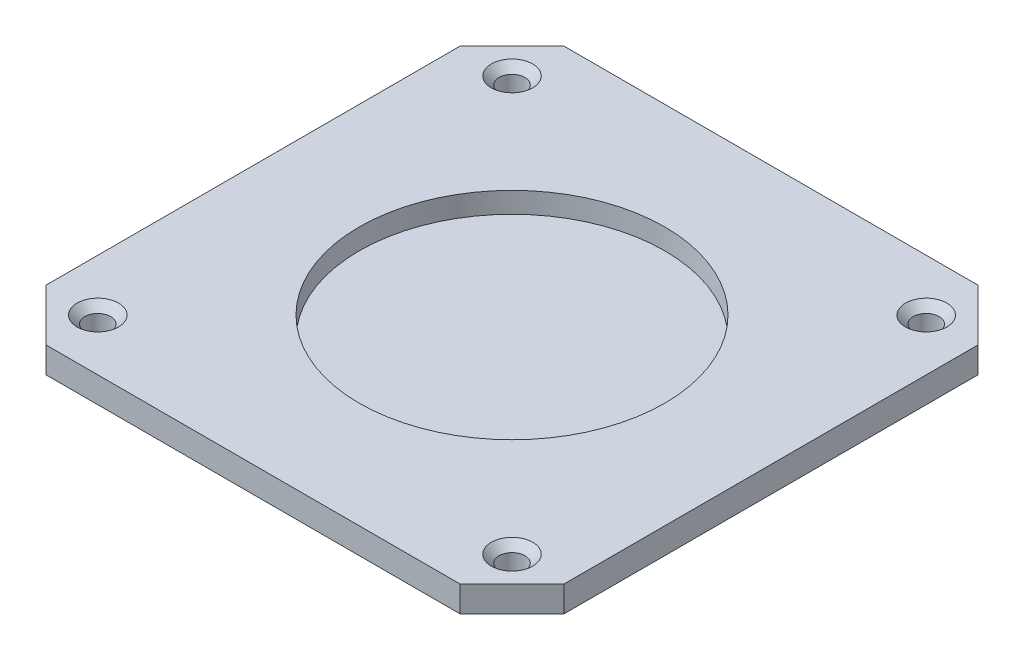
ISO-10303-21;
HEADER;
FILE_DESCRIPTION(('STEP AP214'),'2;1');
FILE_NAME('part.step','',(''),(''),'','','');
FILE_SCHEMA(('AUTOMOTIVE_DESIGN { 1 0 10303 214 1 1 1 1 }'));
ENDSEC;
DATA;
#1=APPLICATION_CONTEXT('core data for automotive mechanical design processes');
#2=APPLICATION_PROTOCOL_DEFINITION('international standard','automotive_design',2000,#1);
#3=PRODUCT_CONTEXT('',#1,'mechanical');
#4=PRODUCT('Part','Part','',(#3));
#5=PRODUCT_RELATED_PRODUCT_CATEGORY('part','',(#4));
#6=PRODUCT_DEFINITION_FORMATION('','',#4);
#7=PRODUCT_DEFINITION_CONTEXT('part definition',#1,'design');
#8=PRODUCT_DEFINITION('design','',#6,#7);
#9=PRODUCT_DEFINITION_SHAPE('','',#8);
#10=(LENGTH_UNIT() NAMED_UNIT(*) SI_UNIT(.MILLI.,.METRE.));
#11=(NAMED_UNIT(*) PLANE_ANGLE_UNIT() SI_UNIT($,.RADIAN.));
#12=(NAMED_UNIT(*) SI_UNIT($,.STERADIAN.) SOLID_ANGLE_UNIT());
#13=UNCERTAINTY_MEASURE_WITH_UNIT(LENGTH_MEASURE(1.E-05),#10,'distance_accuracy_value','');
#14=(GEOMETRIC_REPRESENTATION_CONTEXT(3) GLOBAL_UNCERTAINTY_ASSIGNED_CONTEXT((#13)) GLOBAL_UNIT_ASSIGNED_CONTEXT((#10,
#11,#12)) REPRESENTATION_CONTEXT('',''));
#15=CARTESIAN_POINT('',(0.,0.,0.));
#16=DIRECTION('',(0.,0.,1.));
#17=DIRECTION('',(1.,0.,0.));
#18=AXIS2_PLACEMENT_3D('',#15,#16,#17);
#19=CARTESIAN_POINT('',(0.,5.,50.));
#20=DIRECTION('',(0.,0.,-1.));
#21=DIRECTION('',(-1.,0.,0.));
#22=AXIS2_PLACEMENT_3D('',#19,#20,#21);
#23=PLANE('',#22);
#24=DIRECTION('',(1.,0.,0.));
#25=VECTOR('',#24,1.);
#26=CARTESIAN_POINT('',(0.,0.,50.));
#27=LINE('',#26,#25);
#28=CARTESIAN_POINT('',(-40.,0.,50.));
#29=VERTEX_POINT('',#28);
#30=CARTESIAN_POINT('',(40.,0.,50.));
#31=VERTEX_POINT('',#30);
#32=EDGE_CURVE('E117',#29,#31,#27,.T.);
#33=ORIENTED_EDGE('',*,*,#32,.T.);
#34=DIRECTION('',(0.,1.,0.));
#35=VECTOR('',#34,1.);
#36=CARTESIAN_POINT('',(40.,5.,50.));
#37=LINE('',#36,#35);
#38=CARTESIAN_POINT('',(40.,5.,50.));
#39=VERTEX_POINT('',#38);
#40=EDGE_CURVE('E168',#31,#39,#37,.T.);
#41=ORIENTED_EDGE('',*,*,#40,.T.);
#42=DIRECTION('',(1.,0.,0.));
#43=VECTOR('',#42,1.);
#44=CARTESIAN_POINT('',(0.,5.,50.));
#45=LINE('',#44,#43);
#46=CARTESIAN_POINT('',(-40.,5.,50.));
#47=VERTEX_POINT('',#46);
#48=EDGE_CURVE('E311',#47,#39,#45,.T.);
#49=ORIENTED_EDGE('',*,*,#48,.F.);
#50=DIRECTION('',(0.,-1.,0.));
#51=VECTOR('',#50,1.);
#52=CARTESIAN_POINT('',(-40.,0.,50.));
#53=LINE('',#52,#51);
#54=EDGE_CURVE('E166',#47,#29,#53,.T.);
#55=ORIENTED_EDGE('',*,*,#54,.T.);
#56=EDGE_LOOP('',(#33,#41,#49,#55));
#57=FACE_BOUND('',#56,.T.);
#58=ADVANCED_FACE('F43',(#57),#23,.F.);
#59=CARTESIAN_POINT('',(50.,5.,0.));
#60=DIRECTION('',(-1.,0.,0.));
#61=DIRECTION('',(0.,0.,1.));
#62=AXIS2_PLACEMENT_3D('',#59,#60,#61);
#63=PLANE('',#62);
#64=DIRECTION('',(0.,0.,-1.));
#65=VECTOR('',#64,1.);
#66=CARTESIAN_POINT('',(50.,0.,0.));
#67=LINE('',#66,#65);
#68=CARTESIAN_POINT('',(50.,0.,40.));
#69=VERTEX_POINT('',#68);
#70=CARTESIAN_POINT('',(50.,0.,-40.));
#71=VERTEX_POINT('',#70);
#72=EDGE_CURVE('E301',#69,#71,#67,.T.);
#73=ORIENTED_EDGE('',*,*,#72,.T.);
#74=DIRECTION('',(0.,1.,0.));
#75=VECTOR('',#74,1.);
#76=CARTESIAN_POINT('',(50.,5.,-40.));
#77=LINE('',#76,#75);
#78=CARTESIAN_POINT('',(50.,5.,-40.));
#79=VERTEX_POINT('',#78);
#80=EDGE_CURVE('E59',#71,#79,#77,.T.);
#81=ORIENTED_EDGE('',*,*,#80,.T.);
#82=DIRECTION('',(0.,0.,-1.));
#83=VECTOR('',#82,1.);
#84=CARTESIAN_POINT('',(50.,5.,0.));
#85=LINE('',#84,#83);
#86=CARTESIAN_POINT('',(50.,5.,40.));
#87=VERTEX_POINT('',#86);
#88=EDGE_CURVE('E296',#87,#79,#85,.T.);
#89=ORIENTED_EDGE('',*,*,#88,.F.);
#90=DIRECTION('',(0.,-1.,0.));
#91=VECTOR('',#90,1.);
#92=CARTESIAN_POINT('',(50.,5.,40.));
#93=LINE('',#92,#91);
#94=EDGE_CURVE('E162',#87,#69,#93,.T.);
#95=ORIENTED_EDGE('',*,*,#94,.T.);
#96=EDGE_LOOP('',(#73,#81,#89,#95));
#97=FACE_BOUND('',#96,.T.);
#98=ADVANCED_FACE('F208',(#97),#63,.F.);
#99=CARTESIAN_POINT('',(0.,5.,-50.));
#100=DIRECTION('',(0.,0.,-1.));
#101=DIRECTION('',(-1.,0.,0.));
#102=AXIS2_PLACEMENT_3D('',#99,#100,#101);
#103=PLANE('',#102);
#104=DIRECTION('',(1.,0.,0.));
#105=VECTOR('',#104,1.);
#106=CARTESIAN_POINT('',(0.,0.,-50.));
#107=LINE('',#106,#105);
#108=CARTESIAN_POINT('',(-40.,0.,-50.));
#109=VERTEX_POINT('',#108);
#110=CARTESIAN_POINT('',(40.,0.,-50.));
#111=VERTEX_POINT('',#110);
#112=EDGE_CURVE('E133',#109,#111,#107,.T.);
#113=ORIENTED_EDGE('',*,*,#112,.F.);
#114=DIRECTION('',(0.,1.,0.));
#115=VECTOR('',#114,1.);
#116=CARTESIAN_POINT('',(-40.,5.,-50.));
#117=LINE('',#116,#115);
#118=CARTESIAN_POINT('',(-40.,5.,-50.));
#119=VERTEX_POINT('',#118);
#120=EDGE_CURVE('E154',#109,#119,#117,.T.);
#121=ORIENTED_EDGE('',*,*,#120,.T.);
#122=DIRECTION('',(1.,0.,0.));
#123=VECTOR('',#122,1.);
#124=CARTESIAN_POINT('',(0.,5.,-50.));
#125=LINE('',#124,#123);
#126=CARTESIAN_POINT('',(40.,5.,-50.));
#127=VERTEX_POINT('',#126);
#128=EDGE_CURVE('E291',#119,#127,#125,.T.);
#129=ORIENTED_EDGE('',*,*,#128,.T.);
#130=DIRECTION('',(0.,-1.,0.));
#131=VECTOR('',#130,1.);
#132=CARTESIAN_POINT('',(40.,0.,-50.));
#133=LINE('',#132,#131);
#134=EDGE_CURVE('E151',#127,#111,#133,.T.);
#135=ORIENTED_EDGE('',*,*,#134,.T.);
#136=EDGE_LOOP('',(#113,#121,#129,#135));
#137=FACE_BOUND('',#136,.T.);
#138=ADVANCED_FACE('F215',(#137),#103,.T.);
#139=CARTESIAN_POINT('',(40.,5.,-40.));
#140=DIRECTION('',(0.,-1.,0.));
#141=DIRECTION('',(0.,0.,-1.));
#142=AXIS2_PLACEMENT_3D('',#139,#140,#141);
#143=CYLINDRICAL_SURFACE('',#142,2.5);
#144=CARTESIAN_POINT('',(40.,3.50000000000002,-40.));
#145=DIRECTION('',(0.,1.,0.));
#146=DIRECTION('',(0.,0.,1.));
#147=AXIS2_PLACEMENT_3D('',#144,#145,#146);
#148=CIRCLE('',#147,2.5);
#149=CARTESIAN_POINT('',(40.,3.50000000000002,-37.5));
#150=VERTEX_POINT('',#149);
#151=EDGE_CURVE('E52',#150,#150,#148,.T.);
#152=ORIENTED_EDGE('',*,*,#151,.T.);
#153=EDGE_LOOP('',(#152));
#154=FACE_BOUND('',#153,.T.);
#155=CARTESIAN_POINT('',(40.,0.,-40.));
#156=DIRECTION('',(0.,1.,0.));
#157=DIRECTION('',(0.,0.,1.));
#158=AXIS2_PLACEMENT_3D('',#155,#156,#157);
#159=CIRCLE('',#158,2.5);
#160=CARTESIAN_POINT('',(40.,0.,-37.5));
#161=VERTEX_POINT('',#160);
#162=EDGE_CURVE('E132',#161,#161,#159,.T.);
#163=ORIENTED_EDGE('',*,*,#162,.F.);
#164=EDGE_LOOP('',(#163));
#165=FACE_BOUND('',#164,.T.);
#166=ADVANCED_FACE('F190',(#154,#165),#143,.F.);
#167=CARTESIAN_POINT('',(-50.,5.,0.));
#168=DIRECTION('',(-1.,0.,0.));
#169=DIRECTION('',(0.,0.,1.));
#170=AXIS2_PLACEMENT_3D('',#167,#168,#169);
#171=PLANE('',#170);
#172=DIRECTION('',(0.,0.,-1.));
#173=VECTOR('',#172,1.);
#174=CARTESIAN_POINT('',(-50.,5.,0.));
#175=LINE('',#174,#173);
#176=CARTESIAN_POINT('',(-50.,5.,40.));
#177=VERTEX_POINT('',#176);
#178=CARTESIAN_POINT('',(-50.,5.,-40.));
#179=VERTEX_POINT('',#178);
#180=EDGE_CURVE('E142',#177,#179,#175,.T.);
#181=ORIENTED_EDGE('',*,*,#180,.T.);
#182=DIRECTION('',(0.,-1.,0.));
#183=VECTOR('',#182,1.);
#184=CARTESIAN_POINT('',(-50.,5.,-40.));
#185=LINE('',#184,#183);
#186=CARTESIAN_POINT('',(-50.,0.,-40.));
#187=VERTEX_POINT('',#186);
#188=EDGE_CURVE('E123',#179,#187,#185,.T.);
#189=ORIENTED_EDGE('',*,*,#188,.T.);
#190=DIRECTION('',(0.,0.,-1.));
#191=VECTOR('',#190,1.);
#192=CARTESIAN_POINT('',(-50.,0.,0.));
#193=LINE('',#192,#191);
#194=CARTESIAN_POINT('',(-50.,0.,40.));
#195=VERTEX_POINT('',#194);
#196=EDGE_CURVE('E115',#195,#187,#193,.T.);
#197=ORIENTED_EDGE('',*,*,#196,.F.);
#198=DIRECTION('',(0.,1.,0.));
#199=VECTOR('',#198,1.);
#200=CARTESIAN_POINT('',(-50.,5.,40.));
#201=LINE('',#200,#199);
#202=EDGE_CURVE('E129',#195,#177,#201,.T.);
#203=ORIENTED_EDGE('',*,*,#202,.T.);
#204=EDGE_LOOP('',(#181,#189,#197,#203));
#205=FACE_BOUND('',#204,.T.);
#206=ADVANCED_FACE('F128',(#205),#171,.T.);
#207=CARTESIAN_POINT('',(0.,5.,0.));
#208=DIRECTION('',(0.,-1.,0.));
#209=DIRECTION('',(0.,0.,-1.));
#210=AXIS2_PLACEMENT_3D('',#207,#208,#209);
#211=CYLINDRICAL_SURFACE('',#210,29.5);
#212=CARTESIAN_POINT('',(0.,1.,0.));
#213=DIRECTION('',(0.,1.,0.));
#214=DIRECTION('',(0.,0.,1.));
#215=AXIS2_PLACEMENT_3D('',#212,#213,#214);
#216=CIRCLE('',#215,29.5);
#217=CARTESIAN_POINT('',(0.,1.,29.5));
#218=VERTEX_POINT('',#217);
#219=EDGE_CURVE('E138',#218,#218,#216,.T.);
#220=ORIENTED_EDGE('',*,*,#219,.F.);
#221=EDGE_LOOP('',(#220));
#222=FACE_BOUND('',#221,.T.);
#223=CARTESIAN_POINT('',(0.,5.,0.));
#224=DIRECTION('',(0.,1.,0.));
#225=DIRECTION('',(0.,0.,1.));
#226=AXIS2_PLACEMENT_3D('',#223,#224,#225);
#227=CIRCLE('',#226,29.5);
#228=CARTESIAN_POINT('',(0.,5.,29.5));
#229=VERTEX_POINT('',#228);
#230=EDGE_CURVE('E288',#229,#229,#227,.T.);
#231=ORIENTED_EDGE('',*,*,#230,.T.);
#232=EDGE_LOOP('',(#231));
#233=FACE_BOUND('',#232,.T.);
#234=ADVANCED_FACE('F219',(#222,#233),#211,.F.);
#235=CARTESIAN_POINT('',(-40.,5.,-40.));
#236=DIRECTION('',(0.,-1.,0.));
#237=DIRECTION('',(0.,0.,-1.));
#238=AXIS2_PLACEMENT_3D('',#235,#236,#237);
#239=CYLINDRICAL_SURFACE('',#238,2.5);
#240=CARTESIAN_POINT('',(-40.,3.50000000000002,-40.));
#241=DIRECTION('',(0.,1.,0.));
#242=DIRECTION('',(0.,0.,1.));
#243=AXIS2_PLACEMENT_3D('',#240,#241,#242);
#244=CIRCLE('',#243,2.5);
#245=CARTESIAN_POINT('',(-40.,3.50000000000002,-37.5));
#246=VERTEX_POINT('',#245);
#247=EDGE_CURVE('E11',#246,#246,#244,.T.);
#248=ORIENTED_EDGE('',*,*,#247,.T.);
#249=EDGE_LOOP('',(#248));
#250=FACE_BOUND('',#249,.T.);
#251=CARTESIAN_POINT('',(-40.,0.,-40.));
#252=DIRECTION('',(0.,1.,0.));
#253=DIRECTION('',(0.,0.,1.));
#254=AXIS2_PLACEMENT_3D('',#251,#252,#253);
#255=CIRCLE('',#254,2.5);
#256=CARTESIAN_POINT('',(-40.,0.,-37.5));
#257=VERTEX_POINT('',#256);
#258=EDGE_CURVE('E321',#257,#257,#255,.T.);
#259=ORIENTED_EDGE('',*,*,#258,.F.);
#260=EDGE_LOOP('',(#259));
#261=FACE_BOUND('',#260,.T.);
#262=ADVANCED_FACE('F222',(#250,#261),#239,.F.);
#263=CARTESIAN_POINT('',(40.,5.,40.));
#264=DIRECTION('',(0.,-1.,0.));
#265=DIRECTION('',(0.,0.,-1.));
#266=AXIS2_PLACEMENT_3D('',#263,#264,#265);
#267=CYLINDRICAL_SURFACE('',#266,2.50000000000001);
#268=CARTESIAN_POINT('',(40.,3.50000000000002,40.));
#269=DIRECTION('',(0.,1.,0.));
#270=DIRECTION('',(0.,0.,1.));
#271=AXIS2_PLACEMENT_3D('',#268,#269,#270);
#272=CIRCLE('',#271,2.50000000000001);
#273=CARTESIAN_POINT('',(40.,3.50000000000002,42.5));
#274=VERTEX_POINT('',#273);
#275=EDGE_CURVE('E185',#274,#274,#272,.T.);
#276=ORIENTED_EDGE('',*,*,#275,.T.);
#277=EDGE_LOOP('',(#276));
#278=FACE_BOUND('',#277,.T.);
#279=CARTESIAN_POINT('',(40.,0.,40.));
#280=DIRECTION('',(0.,1.,0.));
#281=DIRECTION('',(0.,0.,1.));
#282=AXIS2_PLACEMENT_3D('',#279,#280,#281);
#283=CIRCLE('',#282,2.50000000000001);
#284=CARTESIAN_POINT('',(40.,0.,42.5));
#285=VERTEX_POINT('',#284);
#286=EDGE_CURVE('E318',#285,#285,#283,.F.);
#287=ORIENTED_EDGE('',*,*,#286,.T.);
#288=EDGE_LOOP('',(#287));
#289=FACE_BOUND('',#288,.T.);
#290=ADVANCED_FACE('F226',(#278,#289),#267,.F.);
#291=CARTESIAN_POINT('',(-40.,5.,40.));
#292=DIRECTION('',(0.,-1.,0.));
#293=DIRECTION('',(0.,0.,-1.));
#294=AXIS2_PLACEMENT_3D('',#291,#292,#293);
#295=CYLINDRICAL_SURFACE('',#294,2.5);
#296=CARTESIAN_POINT('',(-40.,3.49999999999999,40.));
#297=DIRECTION('',(0.,1.,0.));
#298=DIRECTION('',(0.,0.,1.));
#299=AXIS2_PLACEMENT_3D('',#296,#297,#298);
#300=CIRCLE('',#299,2.5);
#301=CARTESIAN_POINT('',(-40.,3.49999999999999,42.5));
#302=VERTEX_POINT('',#301);
#303=EDGE_CURVE('E182',#302,#302,#300,.T.);
#304=ORIENTED_EDGE('',*,*,#303,.T.);
#305=EDGE_LOOP('',(#304));
#306=FACE_BOUND('',#305,.T.);
#307=CARTESIAN_POINT('',(-40.,0.,40.));
#308=DIRECTION('',(0.,1.,0.));
#309=DIRECTION('',(0.,0.,1.));
#310=AXIS2_PLACEMENT_3D('',#307,#308,#309);
#311=CIRCLE('',#310,2.5);
#312=CARTESIAN_POINT('',(-40.,0.,42.5));
#313=VERTEX_POINT('',#312);
#314=EDGE_CURVE('E307',#313,#313,#311,.F.);
#315=ORIENTED_EDGE('',*,*,#314,.T.);
#316=EDGE_LOOP('',(#315));
#317=FACE_BOUND('',#316,.T.);
#318=ADVANCED_FACE('F230',(#306,#317),#295,.F.);
#319=CARTESIAN_POINT('',(0.,5.,0.));
#320=DIRECTION('',(0.,1.,0.));
#321=DIRECTION('',(0.,0.,1.));
#322=AXIS2_PLACEMENT_3D('',#319,#320,#321);
#323=PLANE('',#322);
#324=CARTESIAN_POINT('',(-40.,5.,40.));
#325=DIRECTION('',(0.,1.,0.));
#326=DIRECTION('',(0.,0.,1.));
#327=AXIS2_PLACEMENT_3D('',#324,#325,#326);
#328=CIRCLE('',#327,4.00000000000002);
#329=CARTESIAN_POINT('',(-40.,5.,44.));
#330=VERTEX_POINT('',#329);
#331=EDGE_CURVE('E179',#330,#330,#328,.F.);
#332=ORIENTED_EDGE('',*,*,#331,.T.);
#333=EDGE_LOOP('',(#332));
#334=FACE_BOUND('',#333,.T.);
#335=CARTESIAN_POINT('',(40.,5.,40.));
#336=DIRECTION('',(0.,1.,0.));
#337=DIRECTION('',(0.,0.,1.));
#338=AXIS2_PLACEMENT_3D('',#335,#336,#337);
#339=CIRCLE('',#338,3.99999999999998);
#340=CARTESIAN_POINT('',(40.,5.,44.));
#341=VERTEX_POINT('',#340);
#342=EDGE_CURVE('E176',#341,#341,#339,.F.);
#343=ORIENTED_EDGE('',*,*,#342,.T.);
#344=EDGE_LOOP('',(#343));
#345=FACE_BOUND('',#344,.T.);
#346=CARTESIAN_POINT('',(40.,5.,-40.));
#347=DIRECTION('',(0.,1.,0.));
#348=DIRECTION('',(0.,0.,1.));
#349=AXIS2_PLACEMENT_3D('',#346,#347,#348);
#350=CIRCLE('',#349,3.99999999999999);
#351=CARTESIAN_POINT('',(40.,5.,-36.));
#352=VERTEX_POINT('',#351);
#353=EDGE_CURVE('E173',#352,#352,#350,.F.);
#354=ORIENTED_EDGE('',*,*,#353,.T.);
#355=EDGE_LOOP('',(#354));
#356=FACE_BOUND('',#355,.T.);
#357=CARTESIAN_POINT('',(-40.,5.,-40.));
#358=DIRECTION('',(0.,1.,0.));
#359=DIRECTION('',(0.,0.,1.));
#360=AXIS2_PLACEMENT_3D('',#357,#358,#359);
#361=CIRCLE('',#360,3.99999999999999);
#362=CARTESIAN_POINT('',(-40.,5.,-36.));
#363=VERTEX_POINT('',#362);
#364=EDGE_CURVE('E170',#363,#363,#361,.F.);
#365=ORIENTED_EDGE('',*,*,#364,.T.);
#366=EDGE_LOOP('',(#365));
#367=FACE_BOUND('',#366,.T.);
#368=ORIENTED_EDGE('',*,*,#230,.F.);
#369=EDGE_LOOP('',(#368));
#370=FACE_BOUND('',#369,.T.);
#371=ORIENTED_EDGE('',*,*,#128,.F.);
#372=DIRECTION('',(0.707106781186549,0.,-0.707106781186546));
#373=VECTOR('',#372,1.);
#374=CARTESIAN_POINT('',(-44.9999999999999,5.,-45.0000000000001));
#375=LINE('',#374,#373);
#376=EDGE_CURVE('E160',#119,#179,#375,.F.);
#377=ORIENTED_EDGE('',*,*,#376,.T.);
#378=ORIENTED_EDGE('',*,*,#180,.F.);
#379=DIRECTION('',(0.707106781186546,0.,0.707106781186549));
#380=VECTOR('',#379,1.);
#381=CARTESIAN_POINT('',(-45.0000000000001,5.,44.9999999999999));
#382=LINE('',#381,#380);
#383=EDGE_CURVE('E137',#177,#47,#382,.T.);
#384=ORIENTED_EDGE('',*,*,#383,.T.);
#385=ORIENTED_EDGE('',*,*,#48,.T.);
#386=DIRECTION('',(-0.707106781186549,0.,0.707106781186546));
#387=VECTOR('',#386,1.);
#388=CARTESIAN_POINT('',(44.9999999999999,5.,45.0000000000001));
#389=LINE('',#388,#387);
#390=EDGE_CURVE('E66',#39,#87,#389,.F.);
#391=ORIENTED_EDGE('',*,*,#390,.T.);
#392=ORIENTED_EDGE('',*,*,#88,.T.);
#393=DIRECTION('',(-0.707106781186546,0.,-0.707106781186549));
#394=VECTOR('',#393,1.);
#395=CARTESIAN_POINT('',(45.0000000000001,5.,-44.9999999999999));
#396=LINE('',#395,#394);
#397=EDGE_CURVE('E158',#79,#127,#396,.T.);
#398=ORIENTED_EDGE('',*,*,#397,.T.);
#399=EDGE_LOOP('',(#371,#377,#378,#384,#385,#391,#392,#398));
#400=FACE_BOUND('',#399,.T.);
#401=ADVANCED_FACE('F278',(#334,#345,#356,#367,#370,#400),#323,.T.);
#402=CARTESIAN_POINT('',(0.,0.,0.));
#403=DIRECTION('',(0.,1.,0.));
#404=DIRECTION('',(0.,0.,1.));
#405=AXIS2_PLACEMENT_3D('',#402,#403,#404);
#406=PLANE('',#405);
#407=ORIENTED_EDGE('',*,*,#286,.F.);
#408=EDGE_LOOP('',(#407));
#409=FACE_BOUND('',#408,.T.);
#410=ORIENTED_EDGE('',*,*,#258,.T.);
#411=EDGE_LOOP('',(#410));
#412=FACE_BOUND('',#411,.T.);
#413=ORIENTED_EDGE('',*,*,#196,.T.);
#414=DIRECTION('',(-0.707106781186549,0.,0.707106781186546));
#415=VECTOR('',#414,1.);
#416=CARTESIAN_POINT('',(-50.,0.,-40.));
#417=LINE('',#416,#415);
#418=EDGE_CURVE('E149',#187,#109,#417,.F.);
#419=ORIENTED_EDGE('',*,*,#418,.T.);
#420=ORIENTED_EDGE('',*,*,#112,.T.);
#421=DIRECTION('',(0.707106781186546,0.,0.707106781186549));
#422=VECTOR('',#421,1.);
#423=CARTESIAN_POINT('',(40.,0.,-50.));
#424=LINE('',#423,#422);
#425=EDGE_CURVE('E147',#111,#71,#424,.T.);
#426=ORIENTED_EDGE('',*,*,#425,.T.);
#427=ORIENTED_EDGE('',*,*,#72,.F.);
#428=DIRECTION('',(0.707106781186549,0.,-0.707106781186546));
#429=VECTOR('',#428,1.);
#430=CARTESIAN_POINT('',(50.,0.,40.));
#431=LINE('',#430,#429);
#432=EDGE_CURVE('E122',#69,#31,#431,.F.);
#433=ORIENTED_EDGE('',*,*,#432,.T.);
#434=ORIENTED_EDGE('',*,*,#32,.F.);
#435=DIRECTION('',(-0.707106781186546,0.,-0.707106781186549));
#436=VECTOR('',#435,1.);
#437=CARTESIAN_POINT('',(-40.,0.,50.));
#438=LINE('',#437,#436);
#439=EDGE_CURVE('E111',#29,#195,#438,.T.);
#440=ORIENTED_EDGE('',*,*,#439,.T.);
#441=EDGE_LOOP('',(#413,#419,#420,#426,#427,#433,#434,#440));
#442=FACE_BOUND('',#441,.T.);
#443=ORIENTED_EDGE('',*,*,#162,.T.);
#444=EDGE_LOOP('',(#443));
#445=FACE_BOUND('',#444,.T.);
#446=ORIENTED_EDGE('',*,*,#314,.F.);
#447=EDGE_LOOP('',(#446));
#448=FACE_BOUND('',#447,.T.);
#449=ADVANCED_FACE('F113',(#409,#412,#442,#445,#448),#406,.F.);
#450=CARTESIAN_POINT('',(0.,1.,0.));
#451=DIRECTION('',(0.,1.,0.));
#452=DIRECTION('',(0.,0.,1.));
#453=AXIS2_PLACEMENT_3D('',#450,#451,#452);
#454=PLANE('',#453);
#455=ORIENTED_EDGE('',*,*,#219,.T.);
#456=EDGE_LOOP('',(#455));
#457=FACE_BOUND('',#456,.T.);
#458=ADVANCED_FACE('F240',(#457),#454,.T.);
#459=CARTESIAN_POINT('',(-50.,5.,-40.));
#460=DIRECTION('',(0.707106781186546,0.,0.707106781186549));
#461=DIRECTION('',(0.,-1.,0.));
#462=AXIS2_PLACEMENT_3D('',#459,#460,#461);
#463=PLANE('',#462);
#464=ORIENTED_EDGE('',*,*,#376,.F.);
#465=ORIENTED_EDGE('',*,*,#120,.F.);
#466=ORIENTED_EDGE('',*,*,#418,.F.);
#467=ORIENTED_EDGE('',*,*,#188,.F.);
#468=EDGE_LOOP('',(#464,#465,#466,#467));
#469=FACE_BOUND('',#468,.T.);
#470=ADVANCED_FACE('F233',(#469),#463,.F.);
#471=CARTESIAN_POINT('',(40.,5.,-50.));
#472=DIRECTION('',(0.707106781186549,0.,-0.707106781186546));
#473=DIRECTION('',(0.,1.,0.));
#474=AXIS2_PLACEMENT_3D('',#471,#472,#473);
#475=PLANE('',#474);
#476=ORIENTED_EDGE('',*,*,#397,.F.);
#477=ORIENTED_EDGE('',*,*,#80,.F.);
#478=ORIENTED_EDGE('',*,*,#425,.F.);
#479=ORIENTED_EDGE('',*,*,#134,.F.);
#480=EDGE_LOOP('',(#476,#477,#478,#479));
#481=FACE_BOUND('',#480,.T.);
#482=ADVANCED_FACE('F239',(#481),#475,.T.);
#483=CARTESIAN_POINT('',(50.,5.,40.));
#484=DIRECTION('',(-0.707106781186546,0.,-0.707106781186549));
#485=DIRECTION('',(0.,-1.,0.));
#486=AXIS2_PLACEMENT_3D('',#483,#484,#485);
#487=PLANE('',#486);
#488=ORIENTED_EDGE('',*,*,#390,.F.);
#489=ORIENTED_EDGE('',*,*,#40,.F.);
#490=ORIENTED_EDGE('',*,*,#432,.F.);
#491=ORIENTED_EDGE('',*,*,#94,.F.);
#492=EDGE_LOOP('',(#488,#489,#490,#491));
#493=FACE_BOUND('',#492,.T.);
#494=ADVANCED_FACE('F247',(#493),#487,.F.);
#495=CARTESIAN_POINT('',(-40.,5.,50.));
#496=DIRECTION('',(-0.707106781186549,0.,0.707106781186546));
#497=DIRECTION('',(0.,1.,0.));
#498=AXIS2_PLACEMENT_3D('',#495,#496,#497);
#499=PLANE('',#498);
#500=ORIENTED_EDGE('',*,*,#383,.F.);
#501=ORIENTED_EDGE('',*,*,#202,.F.);
#502=ORIENTED_EDGE('',*,*,#439,.F.);
#503=ORIENTED_EDGE('',*,*,#54,.F.);
#504=EDGE_LOOP('',(#500,#501,#502,#503));
#505=FACE_BOUND('',#504,.T.);
#506=ADVANCED_FACE('F136',(#505),#499,.T.);
#507=CARTESIAN_POINT('',(-40.,5.,40.));
#508=DIRECTION('',(0.,1.,0.));
#509=DIRECTION('',(0.,0.,1.));
#510=AXIS2_PLACEMENT_3D('',#507,#508,#509);
#511=CONICAL_SURFACE('',#510,4.00000000000002,0.785398163397449);
#512=ORIENTED_EDGE('',*,*,#303,.F.);
#513=EDGE_LOOP('',(#512));
#514=FACE_BOUND('',#513,.T.);
#515=ORIENTED_EDGE('',*,*,#331,.F.);
#516=EDGE_LOOP('',(#515));
#517=FACE_BOUND('',#516,.T.);
#518=ADVANCED_FACE('F202',(#514,#517),#511,.F.);
#519=CARTESIAN_POINT('',(40.,5.,40.));
#520=DIRECTION('',(0.,1.,0.));
#521=DIRECTION('',(0.,0.,1.));
#522=AXIS2_PLACEMENT_3D('',#519,#520,#521);
#523=CONICAL_SURFACE('',#522,3.99999999999998,0.785398163397444);
#524=ORIENTED_EDGE('',*,*,#275,.F.);
#525=EDGE_LOOP('',(#524));
#526=FACE_BOUND('',#525,.T.);
#527=ORIENTED_EDGE('',*,*,#342,.F.);
#528=EDGE_LOOP('',(#527));
#529=FACE_BOUND('',#528,.T.);
#530=ADVANCED_FACE('F195',(#526,#529),#523,.F.);
#531=CARTESIAN_POINT('',(40.,3.50000000000002,-40.));
#532=DIRECTION('',(0.,1.,0.));
#533=DIRECTION('',(0.,0.,1.));
#534=AXIS2_PLACEMENT_3D('',#531,#532,#533);
#535=CONICAL_SURFACE('',#534,2.5,0.78539816339745);
#536=ORIENTED_EDGE('',*,*,#353,.F.);
#537=EDGE_LOOP('',(#536));
#538=FACE_BOUND('',#537,.T.);
#539=ORIENTED_EDGE('',*,*,#151,.F.);
#540=EDGE_LOOP('',(#539));
#541=FACE_BOUND('',#540,.T.);
#542=ADVANCED_FACE('F193',(#538,#541),#535,.F.);
#543=CARTESIAN_POINT('',(-40.,3.50000000000002,-40.));
#544=DIRECTION('',(0.,1.,0.));
#545=DIRECTION('',(0.,0.,1.));
#546=AXIS2_PLACEMENT_3D('',#543,#544,#545);
#547=CONICAL_SURFACE('',#546,2.5,0.78539816339745);
#548=ORIENTED_EDGE('',*,*,#364,.F.);
#549=EDGE_LOOP('',(#548));
#550=FACE_BOUND('',#549,.T.);
#551=ORIENTED_EDGE('',*,*,#247,.F.);
#552=EDGE_LOOP('',(#551));
#553=FACE_BOUND('',#552,.T.);
#554=ADVANCED_FACE('F46',(#550,#553),#547,.F.);
#555=CLOSED_SHELL('',(#58,#98,#138,#166,#206,#234,#262,#290,#318,#401,#449,#458,#470,#482,#494,
#506,#518,#530,#542,#554));
#556=MANIFOLD_SOLID_BREP('B2',#555);
#557=ADVANCED_BREP_SHAPE_REPRESENTATION('',(#18,#556),#14);
#558=SHAPE_DEFINITION_REPRESENTATION(#9,#557);
ENDSEC;
END-ISO-10303-21;
